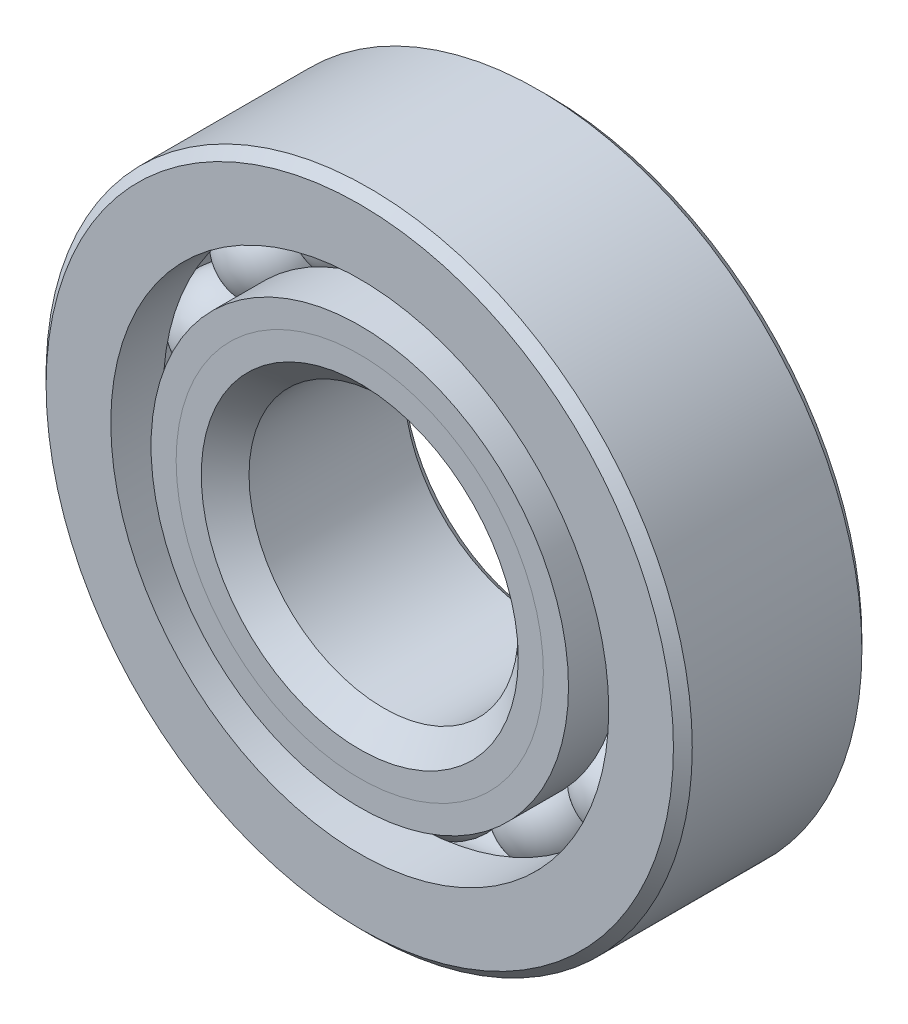
ISO-10303-21;
HEADER;
FILE_DESCRIPTION(('STEP AP214'),'2;1');
FILE_NAME('part.step','',(''),(''),'','','');
FILE_SCHEMA(('AUTOMOTIVE_DESIGN { 1 0 10303 214 1 1 1 1 }'));
ENDSEC;
DATA;
#1=APPLICATION_CONTEXT('core data for automotive mechanical design processes');
#2=APPLICATION_PROTOCOL_DEFINITION('international standard','automotive_design',2000,#1);
#3=PRODUCT_CONTEXT('',#1,'mechanical');
#4=PRODUCT('Part','Part','',(#3));
#5=PRODUCT_RELATED_PRODUCT_CATEGORY('part','',(#4));
#6=PRODUCT_DEFINITION_FORMATION('','',#4);
#7=PRODUCT_DEFINITION_CONTEXT('part definition',#1,'design');
#8=PRODUCT_DEFINITION('design','',#6,#7);
#9=PRODUCT_DEFINITION_SHAPE('','',#8);
#10=(LENGTH_UNIT() NAMED_UNIT(*) SI_UNIT(.MILLI.,.METRE.));
#11=(NAMED_UNIT(*) PLANE_ANGLE_UNIT() SI_UNIT($,.RADIAN.));
#12=(NAMED_UNIT(*) SI_UNIT($,.STERADIAN.) SOLID_ANGLE_UNIT());
#13=UNCERTAINTY_MEASURE_WITH_UNIT(LENGTH_MEASURE(1.E-05),#10,'distance_accuracy_value','');
#14=(GEOMETRIC_REPRESENTATION_CONTEXT(3) GLOBAL_UNCERTAINTY_ASSIGNED_CONTEXT((#13)) GLOBAL_UNIT_ASSIGNED_CONTEXT((#10,
#11,#12)) REPRESENTATION_CONTEXT('',''));
#15=CARTESIAN_POINT('',(0.,0.,0.));
#16=DIRECTION('',(0.,0.,1.));
#17=DIRECTION('',(1.,0.,0.));
#18=AXIS2_PLACEMENT_3D('',#15,#16,#17);
#19=CARTESIAN_POINT('',(-5.85471870471739,12.1574486612583,0.));
#20=DIRECTION('',(0.,0.,1.));
#21=DIRECTION('',(-0.433883739117546,0.900968867902425,0.));
#22=AXIS2_PLACEMENT_3D('',#19,#20,#21);
#23=SPHERICAL_SURFACE('',#22,2.7395944072384);
#24=CARTESIAN_POINT('',(-5.85471870471739,12.1574486612583,2.7395944072384));
#25=VERTEX_POINT('',#24);
#26=VERTEX_LOOP('',#25);
#27=FACE_BOUND('',#26,.T.);
#28=ADVANCED_FACE('F43',(#27),#23,.T.);
#29=CLOSED_SHELL('',(#28));
#30=MANIFOLD_SOLID_BREP('B2',#29);
#31=CARTESIAN_POINT('',(-10.5498385665529,8.41321551383141,0.));
#32=DIRECTION('',(0.,0.,1.));
#33=DIRECTION('',(-0.781831482468022,0.623489801858743,0.));
#34=AXIS2_PLACEMENT_3D('',#31,#32,#33);
#35=SPHERICAL_SURFACE('',#34,2.7395944072384);
#36=CARTESIAN_POINT('',(-10.5498385665529,8.41321551383141,2.7395944072384));
#37=VERTEX_POINT('',#36);
#38=VERTEX_LOOP('',#37);
#39=FACE_BOUND('',#38,.T.);
#40=ADVANCED_FACE('F76',(#39),#35,.T.);
#41=CLOSED_SHELL('',(#40));
#42=MANIFOLD_SOLID_BREP('B6',#41);
#43=CARTESIAN_POINT('',(-13.1554335150035,3.00264185257316,0.));
#44=DIRECTION('',(0.,0.,1.));
#45=DIRECTION('',(-0.974927912181821,0.222520933956325,0.));
#46=AXIS2_PLACEMENT_3D('',#43,#44,#45);
#47=SPHERICAL_SURFACE('',#46,2.7395944072384);
#48=CARTESIAN_POINT('',(-13.1554335150035,3.00264185257316,2.7395944072384));
#49=VERTEX_POINT('',#48);
#50=VERTEX_LOOP('',#49);
#51=FACE_BOUND('',#50,.T.);
#52=ADVANCED_FACE('F109',(#51),#47,.T.);
#53=CLOSED_SHELL('',(#52));
#54=MANIFOLD_SOLID_BREP('B39',#53);
#55=CARTESIAN_POINT('',(-13.1554335150035,-3.00264185257289,0.));
#56=DIRECTION('',(0.,0.,1.));
#57=DIRECTION('',(-0.974927912181826,-0.222520933956305,0.));
#58=AXIS2_PLACEMENT_3D('',#55,#56,#57);
#59=SPHERICAL_SURFACE('',#58,2.7395944072384);
#60=CARTESIAN_POINT('',(-13.1554335150035,-3.00264185257289,2.7395944072384));
#61=VERTEX_POINT('',#60);
#62=VERTEX_LOOP('',#61);
#63=FACE_BOUND('',#62,.T.);
#64=ADVANCED_FACE('F142',(#63),#59,.T.);
#65=CLOSED_SHELL('',(#64));
#66=MANIFOLD_SOLID_BREP('B72',#65);
#67=CARTESIAN_POINT('',(-10.5498385665531,-8.41321551383119,0.));
#68=DIRECTION('',(0.,0.,1.));
#69=DIRECTION('',(-0.781831482468035,-0.623489801858727,0.));
#70=AXIS2_PLACEMENT_3D('',#67,#68,#69);
#71=SPHERICAL_SURFACE('',#70,2.7395944072384);
#72=CARTESIAN_POINT('',(-10.5498385665531,-8.41321551383119,2.7395944072384));
#73=VERTEX_POINT('',#72);
#74=VERTEX_LOOP('',#73);
#75=FACE_BOUND('',#74,.T.);
#76=ADVANCED_FACE('F173',(#75),#71,.T.);
#77=CLOSED_SHELL('',(#76));
#78=MANIFOLD_SOLID_BREP('B105',#77);
#79=CARTESIAN_POINT('',(-5.85471870471765,-12.1574486612582,0.));
#80=DIRECTION('',(0.,0.,1.));
#81=DIRECTION('',(-0.433883739117565,-0.900968867902416,0.));
#82=AXIS2_PLACEMENT_3D('',#79,#80,#81);
#83=SPHERICAL_SURFACE('',#82,2.7395944072384);
#84=CARTESIAN_POINT('',(-5.85471870471765,-12.1574486612582,2.7395944072384));
#85=VERTEX_POINT('',#84);
#86=VERTEX_LOOP('',#85);
#87=FACE_BOUND('',#86,.T.);
#88=ADVANCED_FACE('F204',(#87),#83,.T.);
#89=CLOSED_SHELL('',(#88));
#90=MANIFOLD_SOLID_BREP('B138',#89);
#91=CARTESIAN_POINT('',(0.,-13.49375,0.));
#92=DIRECTION('',(0.,0.,1.));
#93=DIRECTION('',(0.,-1.,0.));
#94=AXIS2_PLACEMENT_3D('',#91,#92,#93);
#95=SPHERICAL_SURFACE('',#94,2.7395944072384);
#96=CARTESIAN_POINT('',(0.,-13.49375,2.7395944072384));
#97=VERTEX_POINT('',#96);
#98=VERTEX_LOOP('',#97);
#99=FACE_BOUND('',#98,.T.);
#100=ADVANCED_FACE('F235',(#99),#95,.T.);
#101=CLOSED_SHELL('',(#100));
#102=MANIFOLD_SOLID_BREP('B169',#101);
#103=CARTESIAN_POINT('',(5.85471870471748,-12.1574486612583,0.));
#104=DIRECTION('',(0.,0.,1.));
#105=DIRECTION('',(0.433883739117553,-0.900968867902422,0.));
#106=AXIS2_PLACEMENT_3D('',#103,#104,#105);
#107=SPHERICAL_SURFACE('',#106,2.7395944072384);
#108=CARTESIAN_POINT('',(5.85471870471748,-12.1574486612583,2.7395944072384));
#109=VERTEX_POINT('',#108);
#110=VERTEX_LOOP('',#109);
#111=FACE_BOUND('',#110,.T.);
#112=ADVANCED_FACE('F266',(#111),#107,.T.);
#113=CLOSED_SHELL('',(#112));
#114=MANIFOLD_SOLID_BREP('B200',#113);
#115=CARTESIAN_POINT('',(10.5498385665529,-8.41321551383134,0.));
#116=DIRECTION('',(0.,0.,1.));
#117=DIRECTION('',(0.781831482468027,-0.623489801858737,0.));
#118=AXIS2_PLACEMENT_3D('',#115,#116,#117);
#119=SPHERICAL_SURFACE('',#118,2.7395944072384);
#120=CARTESIAN_POINT('',(10.5498385665529,-8.41321551383134,2.7395944072384));
#121=VERTEX_POINT('',#120);
#122=VERTEX_LOOP('',#121);
#123=FACE_BOUND('',#122,.T.);
#124=ADVANCED_FACE('F299',(#123),#119,.T.);
#125=CLOSED_SHELL('',(#124));
#126=MANIFOLD_SOLID_BREP('B231',#125);
#127=CARTESIAN_POINT('',(13.1554335150035,-3.00264185257307,0.));
#128=DIRECTION('',(0.,0.,1.));
#129=DIRECTION('',(0.974927912181823,-0.222520933956318,0.));
#130=AXIS2_PLACEMENT_3D('',#127,#128,#129);
#131=SPHERICAL_SURFACE('',#130,2.7395944072384);
#132=CARTESIAN_POINT('',(13.1554335150035,-3.00264185257307,2.7395944072384));
#133=VERTEX_POINT('',#132);
#134=VERTEX_LOOP('',#133);
#135=FACE_BOUND('',#134,.T.);
#136=ADVANCED_FACE('F332',(#135),#131,.T.);
#137=CLOSED_SHELL('',(#136));
#138=MANIFOLD_SOLID_BREP('B262',#137);
#139=CARTESIAN_POINT('',(13.1554335150035,3.00264185257298,0.));
#140=DIRECTION('',(0.,0.,1.));
#141=DIRECTION('',(0.974927912181824,0.222520933956311,0.));
#142=AXIS2_PLACEMENT_3D('',#139,#140,#141);
#143=SPHERICAL_SURFACE('',#142,2.7395944072384);
#144=CARTESIAN_POINT('',(13.1554335150035,3.00264185257298,2.7395944072384));
#145=VERTEX_POINT('',#144);
#146=VERTEX_LOOP('',#145);
#147=FACE_BOUND('',#146,.T.);
#148=ADVANCED_FACE('F363',(#147),#143,.T.);
#149=CLOSED_SHELL('',(#148));
#150=MANIFOLD_SOLID_BREP('B295',#149);
#151=CARTESIAN_POINT('',(10.549838566553,8.41321551383127,0.));
#152=DIRECTION('',(0.,0.,1.));
#153=DIRECTION('',(0.781831482468031,0.623489801858732,0.));
#154=AXIS2_PLACEMENT_3D('',#151,#152,#153);
#155=SPHERICAL_SURFACE('',#154,2.7395944072384);
#156=CARTESIAN_POINT('',(10.549838566553,8.41321551383127,2.7395944072384));
#157=VERTEX_POINT('',#156);
#158=VERTEX_LOOP('',#157);
#159=FACE_BOUND('',#158,.T.);
#160=ADVANCED_FACE('F394',(#159),#155,.T.);
#161=CLOSED_SHELL('',(#160));
#162=MANIFOLD_SOLID_BREP('B328',#161);
#163=CARTESIAN_POINT('',(5.85471870471756,12.1574486612583,0.));
#164=DIRECTION('',(0.,0.,1.));
#165=DIRECTION('',(0.433883739117559,0.900968867902419,0.));
#166=AXIS2_PLACEMENT_3D('',#163,#164,#165);
#167=SPHERICAL_SURFACE('',#166,2.7395944072384);
#168=CARTESIAN_POINT('',(5.85471870471756,12.1574486612583,2.7395944072384));
#169=VERTEX_POINT('',#168);
#170=VERTEX_LOOP('',#169);
#171=FACE_BOUND('',#170,.T.);
#172=ADVANCED_FACE('F427',(#171),#167,.T.);
#173=CLOSED_SHELL('',(#172));
#174=MANIFOLD_SOLID_BREP('B359',#173);
#175=CARTESIAN_POINT('',(0.,13.49375,0.));
#176=DIRECTION('',(0.,0.,1.));
#177=DIRECTION('',(0.,1.,0.));
#178=AXIS2_PLACEMENT_3D('',#175,#176,#177);
#179=SPHERICAL_SURFACE('',#178,2.7395944072384);
#180=CARTESIAN_POINT('',(0.,13.49375,2.7395944072384));
#181=VERTEX_POINT('',#180);
#182=VERTEX_LOOP('',#181);
#183=FACE_BOUND('',#182,.T.);
#184=ADVANCED_FACE('F462',(#183),#179,.T.);
#185=CLOSED_SHELL('',(#184));
#186=MANIFOLD_SOLID_BREP('B390',#185);
#187=CARTESIAN_POINT('',(0.,10.8266570300585,5.55625));
#188=DIRECTION('',(0.,0.,-1.));
#189=DIRECTION('',(-1.,0.,0.));
#190=AXIS2_PLACEMENT_3D('',#187,#188,#189);
#191=PLANE('',#190);
#192=CARTESIAN_POINT('',(0.,0.,5.55625));
#193=DIRECTION('',(0.,0.,1.));
#194=DIRECTION('',(1.,0.,0.));
#195=AXIS2_PLACEMENT_3D('',#192,#193,#194);
#196=CIRCLE('',#195,9.3458277963808);
#197=CARTESIAN_POINT('',(9.3458277963808,0.,5.55625));
#198=VERTEX_POINT('',#197);
#199=EDGE_CURVE('E516',#198,#198,#196,.T.);
#200=ORIENTED_EDGE('',*,*,#199,.F.);
#201=EDGE_LOOP('',(#200));
#202=FACE_BOUND('',#201,.T.);
#203=CARTESIAN_POINT('',(0.,0.,5.55625));
#204=DIRECTION('',(0.,0.,1.));
#205=DIRECTION('',(1.,0.,0.));
#206=AXIS2_PLACEMENT_3D('',#203,#204,#205);
#207=CIRCLE('',#206,10.8266570300585);
#208=CARTESIAN_POINT('',(10.8266570300585,0.,5.55625));
#209=VERTEX_POINT('',#208);
#210=EDGE_CURVE('E461',#209,#209,#207,.T.);
#211=ORIENTED_EDGE('',*,*,#210,.T.);
#212=EDGE_LOOP('',(#211));
#213=FACE_BOUND('',#212,.T.);
#214=ADVANCED_FACE('F482',(#202,#213),#191,.F.);
#215=CARTESIAN_POINT('',(0.,0.,4.07542076632228));
#216=DIRECTION('',(0.,0.,1.));
#217=DIRECTION('',(1.,0.,0.));
#218=AXIS2_PLACEMENT_3D('',#215,#216,#217);
#219=CONICAL_SURFACE('',#218,9.3458277963808,0.785398163397451);
#220=ORIENTED_EDGE('',*,*,#210,.F.);
#221=EDGE_LOOP('',(#220));
#222=FACE_BOUND('',#221,.T.);
#223=CARTESIAN_POINT('',(0.,0.,4.07542076632228));
#224=DIRECTION('',(0.,0.,1.));
#225=DIRECTION('',(1.,0.,0.));
#226=AXIS2_PLACEMENT_3D('',#223,#224,#225);
#227=CIRCLE('',#226,9.3458277963808);
#228=CARTESIAN_POINT('',(9.3458277963808,0.,4.07542076632228));
#229=VERTEX_POINT('',#228);
#230=EDGE_CURVE('E488',#229,#229,#227,.T.);
#231=ORIENTED_EDGE('',*,*,#230,.T.);
#232=EDGE_LOOP('',(#231));
#233=FACE_BOUND('',#232,.T.);
#234=ADVANCED_FACE('F523',(#222,#233),#219,.T.);
#235=CARTESIAN_POINT('',(0.,0.,5.55625));
#236=DIRECTION('',(0.,0.,1.));
#237=DIRECTION('',(1.,0.,0.));
#238=AXIS2_PLACEMENT_3D('',#235,#236,#237);
#239=CYLINDRICAL_SURFACE('',#238,9.3458277963808);
#240=ORIENTED_EDGE('',*,*,#230,.F.);
#241=EDGE_LOOP('',(#240));
#242=FACE_BOUND('',#241,.T.);
#243=CARTESIAN_POINT('',(0.,0.,0.));
#244=DIRECTION('',(0.,0.,1.));
#245=DIRECTION('',(1.,0.,0.));
#246=AXIS2_PLACEMENT_3D('',#243,#244,#245);
#247=CIRCLE('',#246,9.3458277963808);
#248=CARTESIAN_POINT('',(9.3458277963808,0.,0.));
#249=VERTEX_POINT('',#248);
#250=EDGE_CURVE('E492',#249,#249,#247,.T.);
#251=ORIENTED_EDGE('',*,*,#250,.T.);
#252=EDGE_LOOP('',(#251));
#253=FACE_BOUND('',#252,.T.);
#254=ADVANCED_FACE('F527',(#242,#253),#239,.T.);
#255=CARTESIAN_POINT('',(0.,9.3458277963808,0.));
#256=DIRECTION('',(0.,0.,-1.));
#257=DIRECTION('',(-1.,0.,0.));
#258=AXIS2_PLACEMENT_3D('',#255,#256,#257);
#259=PLANE('',#258);
#260=ORIENTED_EDGE('',*,*,#250,.F.);
#261=EDGE_LOOP('',(#260));
#262=FACE_BOUND('',#261,.T.);
#263=CARTESIAN_POINT('',(0.,0.,0.));
#264=DIRECTION('',(0.,0.,1.));
#265=DIRECTION('',(1.,0.,0.));
#266=AXIS2_PLACEMENT_3D('',#263,#264,#265);
#267=CIRCLE('',#266,10.7541555927616);
#268=CARTESIAN_POINT('',(10.7541555927616,0.,0.));
#269=VERTEX_POINT('',#268);
#270=EDGE_CURVE('E496',#269,#269,#267,.T.);
#271=ORIENTED_EDGE('',*,*,#270,.T.);
#272=EDGE_LOOP('',(#271));
#273=FACE_BOUND('',#272,.T.);
#274=ADVANCED_FACE('F532',(#262,#273),#259,.F.);
#275=CARTESIAN_POINT('',(0.,0.,0.));
#276=DIRECTION('',(0.,0.,1.));
#277=DIRECTION('',(1.,0.,0.));
#278=AXIS2_PLACEMENT_3D('',#275,#276,#277);
#279=TOROIDAL_SURFACE('',#278,13.49375,2.7395944072384);
#280=ORIENTED_EDGE('',*,*,#270,.F.);
#281=EDGE_LOOP('',(#280));
#282=FACE_BOUND('',#281,.T.);
#283=CARTESIAN_POINT('',(0.,0.,-2.46944444444444));
#284=DIRECTION('',(0.,0.,1.));
#285=DIRECTION('',(1.,0.,0.));
#286=AXIS2_PLACEMENT_3D('',#283,#284,#285);
#287=CIRCLE('',#286,12.3074862637363);
#288=CARTESIAN_POINT('',(12.3074862637363,0.,-2.46944444444444));
#289=VERTEX_POINT('',#288);
#290=EDGE_CURVE('E501',#289,#289,#287,.T.);
#291=ORIENTED_EDGE('',*,*,#290,.T.);
#292=EDGE_LOOP('',(#291));
#293=FACE_BOUND('',#292,.T.);
#294=ADVANCED_FACE('F538',(#282,#293),#279,.F.);
#295=CARTESIAN_POINT('',(0.,0.,5.55625));
#296=DIRECTION('',(0.,0.,1.));
#297=DIRECTION('',(1.,0.,0.));
#298=AXIS2_PLACEMENT_3D('',#295,#296,#297);
#299=CYLINDRICAL_SURFACE('',#298,12.3074862637363);
#300=ORIENTED_EDGE('',*,*,#290,.F.);
#301=EDGE_LOOP('',(#300));
#302=FACE_BOUND('',#301,.T.);
#303=CARTESIAN_POINT('',(0.,0.,-5.55625));
#304=DIRECTION('',(0.,0.,1.));
#305=DIRECTION('',(1.,0.,0.));
#306=AXIS2_PLACEMENT_3D('',#303,#304,#305);
#307=CIRCLE('',#306,12.3074862637363);
#308=CARTESIAN_POINT('',(12.3074862637363,0.,-5.55625));
#309=VERTEX_POINT('',#308);
#310=EDGE_CURVE('E504',#309,#309,#307,.T.);
#311=ORIENTED_EDGE('',*,*,#310,.T.);
#312=EDGE_LOOP('',(#311));
#313=FACE_BOUND('',#312,.T.);
#314=ADVANCED_FACE('F542',(#302,#313),#299,.T.);
#315=CARTESIAN_POINT('',(0.,8.493125,-5.55625));
#316=DIRECTION('',(0.,0.,1.));
#317=DIRECTION('',(1.,0.,0.));
#318=AXIS2_PLACEMENT_3D('',#315,#316,#317);
#319=PLANE('',#318);
#320=ORIENTED_EDGE('',*,*,#310,.F.);
#321=EDGE_LOOP('',(#320));
#322=FACE_BOUND('',#321,.T.);
#323=CARTESIAN_POINT('',(0.,0.,-5.55625));
#324=DIRECTION('',(0.,0.,1.));
#325=DIRECTION('',(1.,0.,0.));
#326=AXIS2_PLACEMENT_3D('',#323,#324,#325);
#327=CIRCLE('',#326,8.493125);
#328=CARTESIAN_POINT('',(8.493125,0.,-5.55625));
#329=VERTEX_POINT('',#328);
#330=EDGE_CURVE('E507',#329,#329,#327,.T.);
#331=ORIENTED_EDGE('',*,*,#330,.T.);
#332=EDGE_LOOP('',(#331));
#333=FACE_BOUND('',#332,.T.);
#334=ADVANCED_FACE('F546',(#322,#333),#319,.F.);
#335=CARTESIAN_POINT('',(0.,0.,-5.000625));
#336=DIRECTION('',(0.,0.,-1.));
#337=DIRECTION('',(-1.,0.,0.));
#338=AXIS2_PLACEMENT_3D('',#335,#336,#337);
#339=CONICAL_SURFACE('',#338,7.9375,0.785398163397447);
#340=ORIENTED_EDGE('',*,*,#330,.F.);
#341=EDGE_LOOP('',(#340));
#342=FACE_BOUND('',#341,.T.);
#343=CARTESIAN_POINT('',(0.,0.,-5.000625));
#344=DIRECTION('',(0.,0.,1.));
#345=DIRECTION('',(1.,0.,0.));
#346=AXIS2_PLACEMENT_3D('',#343,#344,#345);
#347=CIRCLE('',#346,7.9375);
#348=CARTESIAN_POINT('',(7.9375,0.,-5.000625));
#349=VERTEX_POINT('',#348);
#350=EDGE_CURVE('E510',#349,#349,#347,.T.);
#351=ORIENTED_EDGE('',*,*,#350,.T.);
#352=EDGE_LOOP('',(#351));
#353=FACE_BOUND('',#352,.T.);
#354=ADVANCED_FACE('F550',(#342,#353),#339,.F.);
#355=CARTESIAN_POINT('',(0.,0.,5.55625));
#356=DIRECTION('',(0.,0.,1.));
#357=DIRECTION('',(1.,0.,0.));
#358=AXIS2_PLACEMENT_3D('',#355,#356,#357);
#359=CYLINDRICAL_SURFACE('',#358,7.9375);
#360=ORIENTED_EDGE('',*,*,#350,.F.);
#361=EDGE_LOOP('',(#360));
#362=FACE_BOUND('',#361,.T.);
#363=CARTESIAN_POINT('',(0.,0.,4.14792220361921));
#364=DIRECTION('',(0.,0.,1.));
#365=DIRECTION('',(1.,0.,0.));
#366=AXIS2_PLACEMENT_3D('',#363,#364,#365);
#367=CIRCLE('',#366,7.9375);
#368=CARTESIAN_POINT('',(7.9375,0.,4.14792220361921));
#369=VERTEX_POINT('',#368);
#370=EDGE_CURVE('E513',#369,#369,#367,.T.);
#371=ORIENTED_EDGE('',*,*,#370,.T.);
#372=EDGE_LOOP('',(#371));
#373=FACE_BOUND('',#372,.T.);
#374=ADVANCED_FACE('F554',(#362,#373),#359,.F.);
#375=CARTESIAN_POINT('',(0.,0.,5.55625));
#376=DIRECTION('',(0.,0.,1.));
#377=DIRECTION('',(1.,0.,0.));
#378=AXIS2_PLACEMENT_3D('',#375,#376,#377);
#379=CONICAL_SURFACE('',#378,9.3458277963808,0.785398163397451);
#380=ORIENTED_EDGE('',*,*,#370,.F.);
#381=EDGE_LOOP('',(#380));
#382=FACE_BOUND('',#381,.T.);
#383=ORIENTED_EDGE('',*,*,#199,.T.);
#384=EDGE_LOOP('',(#383));
#385=FACE_BOUND('',#384,.T.);
#386=ADVANCED_FACE('F520',(#382,#385),#379,.F.);
#387=CLOSED_SHELL('',(#214,#234,#254,#274,#294,#314,#334,#354,#374,#386));
#388=MANIFOLD_SOLID_BREP('B423',#387);
#389=CARTESIAN_POINT('',(0.,12.3074862637363,5.55625));
#390=DIRECTION('',(0.,0.,-1.));
#391=DIRECTION('',(-1.,0.,0.));
#392=AXIS2_PLACEMENT_3D('',#389,#390,#391);
#393=PLANE('',#392);
#394=CARTESIAN_POINT('',(0.,0.,5.55625));
#395=DIRECTION('',(0.,0.,1.));
#396=DIRECTION('',(1.,0.,0.));
#397=AXIS2_PLACEMENT_3D('',#394,#395,#396);
#398=CIRCLE('',#397,10.8266570300585);
#399=CARTESIAN_POINT('',(10.8266570300585,0.,5.55625));
#400=VERTEX_POINT('',#399);
#401=EDGE_CURVE('E481',#400,#400,#398,.T.);
#402=ORIENTED_EDGE('',*,*,#401,.F.);
#403=EDGE_LOOP('',(#402));
#404=FACE_BOUND('',#403,.T.);
#405=CARTESIAN_POINT('',(0.,0.,5.55625));
#406=DIRECTION('',(0.,0.,1.));
#407=DIRECTION('',(1.,0.,0.));
#408=AXIS2_PLACEMENT_3D('',#405,#406,#407);
#409=CIRCLE('',#408,12.3074862637363);
#410=CARTESIAN_POINT('',(12.3074862637363,0.,5.55625));
#411=VERTEX_POINT('',#410);
#412=EDGE_CURVE('E662',#411,#411,#409,.T.);
#413=ORIENTED_EDGE('',*,*,#412,.T.);
#414=EDGE_LOOP('',(#413));
#415=FACE_BOUND('',#414,.T.);
#416=ADVANCED_FACE('F640',(#404,#415),#393,.F.);
#417=CARTESIAN_POINT('',(0.,0.,5.55625));
#418=DIRECTION('',(0.,0.,1.));
#419=DIRECTION('',(1.,0.,0.));
#420=AXIS2_PLACEMENT_3D('',#417,#418,#419);
#421=CONICAL_SURFACE('',#420,10.8266570300585,0.785398163397451);
#422=CARTESIAN_POINT('',(0.,0.,4.07542076632228));
#423=DIRECTION('',(0.,0.,1.));
#424=DIRECTION('',(1.,0.,0.));
#425=AXIS2_PLACEMENT_3D('',#422,#423,#424);
#426=CIRCLE('',#425,9.3458277963808);
#427=CARTESIAN_POINT('',(9.3458277963808,0.,4.07542076632228));
#428=VERTEX_POINT('',#427);
#429=EDGE_CURVE('E646',#428,#428,#426,.T.);
#430=ORIENTED_EDGE('',*,*,#429,.F.);
#431=EDGE_LOOP('',(#430));
#432=FACE_BOUND('',#431,.T.);
#433=ORIENTED_EDGE('',*,*,#401,.T.);
#434=EDGE_LOOP('',(#433));
#435=FACE_BOUND('',#434,.T.);
#436=ADVANCED_FACE('F687',(#432,#435),#421,.F.);
#437=CARTESIAN_POINT('',(0.,0.,5.55625));
#438=DIRECTION('',(0.,0.,1.));
#439=DIRECTION('',(1.,0.,0.));
#440=AXIS2_PLACEMENT_3D('',#437,#438,#439);
#441=CYLINDRICAL_SURFACE('',#440,9.3458277963808);
#442=CARTESIAN_POINT('',(0.,0.,0.));
#443=DIRECTION('',(0.,0.,1.));
#444=DIRECTION('',(1.,0.,0.));
#445=AXIS2_PLACEMENT_3D('',#442,#443,#444);
#446=CIRCLE('',#445,9.3458277963808);
#447=CARTESIAN_POINT('',(9.3458277963808,0.,0.));
#448=VERTEX_POINT('',#447);
#449=EDGE_CURVE('E650',#448,#448,#446,.T.);
#450=ORIENTED_EDGE('',*,*,#449,.F.);
#451=EDGE_LOOP('',(#450));
#452=FACE_BOUND('',#451,.T.);
#453=ORIENTED_EDGE('',*,*,#429,.T.);
#454=EDGE_LOOP('',(#453));
#455=FACE_BOUND('',#454,.T.);
#456=ADVANCED_FACE('F682',(#452,#455),#441,.F.);
#457=CARTESIAN_POINT('',(0.,9.3458277963808,0.));
#458=DIRECTION('',(0.,0.,1.));
#459=DIRECTION('',(1.,0.,0.));
#460=AXIS2_PLACEMENT_3D('',#457,#458,#459);
#461=PLANE('',#460);
#462=CARTESIAN_POINT('',(0.,0.,0.));
#463=DIRECTION('',(0.,0.,1.));
#464=DIRECTION('',(1.,0.,0.));
#465=AXIS2_PLACEMENT_3D('',#462,#463,#464);
#466=CIRCLE('',#465,10.7541555927616);
#467=CARTESIAN_POINT('',(10.7541555927616,0.,0.));
#468=VERTEX_POINT('',#467);
#469=EDGE_CURVE('E654',#468,#468,#466,.T.);
#470=ORIENTED_EDGE('',*,*,#469,.F.);
#471=EDGE_LOOP('',(#470));
#472=FACE_BOUND('',#471,.T.);
#473=ORIENTED_EDGE('',*,*,#449,.T.);
#474=EDGE_LOOP('',(#473));
#475=FACE_BOUND('',#474,.T.);
#476=ADVANCED_FACE('F676',(#472,#475),#461,.F.);
#477=CARTESIAN_POINT('',(0.,0.,0.));
#478=DIRECTION('',(0.,0.,1.));
#479=DIRECTION('',(1.,0.,0.));
#480=AXIS2_PLACEMENT_3D('',#477,#478,#479);
#481=TOROIDAL_SURFACE('',#480,13.49375,2.7395944072384);
#482=CARTESIAN_POINT('',(0.,0.,2.46944444444444));
#483=DIRECTION('',(0.,0.,1.));
#484=DIRECTION('',(1.,0.,0.));
#485=AXIS2_PLACEMENT_3D('',#482,#483,#484);
#486=CIRCLE('',#485,12.3074862637363);
#487=CARTESIAN_POINT('',(12.3074862637363,0.,2.46944444444444));
#488=VERTEX_POINT('',#487);
#489=EDGE_CURVE('E659',#488,#488,#486,.T.);
#490=ORIENTED_EDGE('',*,*,#489,.F.);
#491=EDGE_LOOP('',(#490));
#492=FACE_BOUND('',#491,.T.);
#493=ORIENTED_EDGE('',*,*,#469,.T.);
#494=EDGE_LOOP('',(#493));
#495=FACE_BOUND('',#494,.T.);
#496=ADVANCED_FACE('F670',(#492,#495),#481,.F.);
#497=CARTESIAN_POINT('',(0.,0.,5.55625));
#498=DIRECTION('',(0.,0.,1.));
#499=DIRECTION('',(1.,0.,0.));
#500=AXIS2_PLACEMENT_3D('',#497,#498,#499);
#501=CYLINDRICAL_SURFACE('',#500,12.3074862637363);
#502=ORIENTED_EDGE('',*,*,#412,.F.);
#503=EDGE_LOOP('',(#502));
#504=FACE_BOUND('',#503,.T.);
#505=ORIENTED_EDGE('',*,*,#489,.T.);
#506=EDGE_LOOP('',(#505));
#507=FACE_BOUND('',#506,.T.);
#508=ADVANCED_FACE('F667',(#504,#507),#501,.T.);
#509=CLOSED_SHELL('',(#416,#436,#456,#476,#496,#508));
#510=MANIFOLD_SOLID_BREP('B456',#509);
#511=CARTESIAN_POINT('',(0.,0.,5.000625));
#512=DIRECTION('',(0.,0.,-1.));
#513=DIRECTION('',(-1.,0.,0.));
#514=AXIS2_PLACEMENT_3D('',#511,#512,#513);
#515=CONICAL_SURFACE('',#514,19.05,0.785398163397446);
#516=CARTESIAN_POINT('',(0.,0.,5.55625));
#517=DIRECTION('',(0.,0.,1.));
#518=DIRECTION('',(1.,0.,0.));
#519=AXIS2_PLACEMENT_3D('',#516,#517,#518);
#520=CIRCLE('',#519,18.494375);
#521=CARTESIAN_POINT('',(18.494375,0.,5.55625));
#522=VERTEX_POINT('',#521);
#523=EDGE_CURVE('E759',#522,#522,#520,.T.);
#524=ORIENTED_EDGE('',*,*,#523,.F.);
#525=EDGE_LOOP('',(#524));
#526=FACE_BOUND('',#525,.T.);
#527=CARTESIAN_POINT('',(0.,0.,5.000625));
#528=DIRECTION('',(0.,0.,1.));
#529=DIRECTION('',(1.,0.,0.));
#530=AXIS2_PLACEMENT_3D('',#527,#528,#529);
#531=CIRCLE('',#530,19.05);
#532=CARTESIAN_POINT('',(19.05,0.,5.000625));
#533=VERTEX_POINT('',#532);
#534=EDGE_CURVE('E639',#533,#533,#531,.T.);
#535=ORIENTED_EDGE('',*,*,#534,.T.);
#536=EDGE_LOOP('',(#535));
#537=FACE_BOUND('',#536,.T.);
#538=ADVANCED_FACE('F731',(#526,#537),#515,.T.);
#539=CARTESIAN_POINT('',(0.,0.,5.55625));
#540=DIRECTION('',(0.,0.,1.));
#541=DIRECTION('',(1.,0.,0.));
#542=AXIS2_PLACEMENT_3D('',#539,#540,#541);
#543=CYLINDRICAL_SURFACE('',#542,19.05);
#544=ORIENTED_EDGE('',*,*,#534,.F.);
#545=EDGE_LOOP('',(#544));
#546=FACE_BOUND('',#545,.T.);
#547=CARTESIAN_POINT('',(0.,0.,-5.000625));
#548=DIRECTION('',(0.,0.,1.));
#549=DIRECTION('',(1.,0.,0.));
#550=AXIS2_PLACEMENT_3D('',#547,#548,#549);
#551=CIRCLE('',#550,19.05);
#552=CARTESIAN_POINT('',(19.05,0.,-5.000625));
#553=VERTEX_POINT('',#552);
#554=EDGE_CURVE('E737',#553,#553,#551,.T.);
#555=ORIENTED_EDGE('',*,*,#554,.T.);
#556=EDGE_LOOP('',(#555));
#557=FACE_BOUND('',#556,.T.);
#558=ADVANCED_FACE('F766',(#546,#557),#543,.T.);
#559=CARTESIAN_POINT('',(0.,0.,-5.55625));
#560=DIRECTION('',(0.,0.,1.));
#561=DIRECTION('',(1.,0.,0.));
#562=AXIS2_PLACEMENT_3D('',#559,#560,#561);
#563=CONICAL_SURFACE('',#562,18.494375,0.785398163397447);
#564=ORIENTED_EDGE('',*,*,#554,.F.);
#565=EDGE_LOOP('',(#564));
#566=FACE_BOUND('',#565,.T.);
#567=CARTESIAN_POINT('',(0.,0.,-5.55625));
#568=DIRECTION('',(0.,0.,1.));
#569=DIRECTION('',(1.,0.,0.));
#570=AXIS2_PLACEMENT_3D('',#567,#568,#569);
#571=CIRCLE('',#570,18.494375);
#572=CARTESIAN_POINT('',(18.494375,0.,-5.55625));
#573=VERTEX_POINT('',#572);
#574=EDGE_CURVE('E741',#573,#573,#571,.T.);
#575=ORIENTED_EDGE('',*,*,#574,.T.);
#576=EDGE_LOOP('',(#575));
#577=FACE_BOUND('',#576,.T.);
#578=ADVANCED_FACE('F770',(#566,#577),#563,.T.);
#579=CARTESIAN_POINT('',(0.,18.494375,-5.55625));
#580=DIRECTION('',(0.,0.,1.));
#581=DIRECTION('',(1.,0.,0.));
#582=AXIS2_PLACEMENT_3D('',#579,#580,#581);
#583=PLANE('',#582);
#584=ORIENTED_EDGE('',*,*,#574,.F.);
#585=EDGE_LOOP('',(#584));
#586=FACE_BOUND('',#585,.T.);
#587=CARTESIAN_POINT('',(0.,0.,-5.55625));
#588=DIRECTION('',(0.,0.,1.));
#589=DIRECTION('',(1.,0.,0.));
#590=AXIS2_PLACEMENT_3D('',#587,#588,#589);
#591=CIRCLE('',#590,14.6800137362637);
#592=CARTESIAN_POINT('',(14.6800137362637,0.,-5.55625));
#593=VERTEX_POINT('',#592);
#594=EDGE_CURVE('E745',#593,#593,#591,.T.);
#595=ORIENTED_EDGE('',*,*,#594,.T.);
#596=EDGE_LOOP('',(#595));
#597=FACE_BOUND('',#596,.T.);
#598=ADVANCED_FACE('F775',(#586,#597),#583,.F.);
#599=CARTESIAN_POINT('',(0.,0.,5.55625));
#600=DIRECTION('',(0.,0.,1.));
#601=DIRECTION('',(1.,0.,0.));
#602=AXIS2_PLACEMENT_3D('',#599,#600,#601);
#603=CYLINDRICAL_SURFACE('',#602,14.6800137362637);
#604=ORIENTED_EDGE('',*,*,#594,.F.);
#605=EDGE_LOOP('',(#604));
#606=FACE_BOUND('',#605,.T.);
#607=CARTESIAN_POINT('',(0.,0.,-2.46944444444444));
#608=DIRECTION('',(0.,0.,1.));
#609=DIRECTION('',(1.,0.,0.));
#610=AXIS2_PLACEMENT_3D('',#607,#608,#609);
#611=CIRCLE('',#610,14.6800137362637);
#612=CARTESIAN_POINT('',(14.6800137362637,0.,-2.46944444444444));
#613=VERTEX_POINT('',#612);
#614=EDGE_CURVE('E750',#613,#613,#611,.T.);
#615=ORIENTED_EDGE('',*,*,#614,.T.);
#616=EDGE_LOOP('',(#615));
#617=FACE_BOUND('',#616,.T.);
#618=ADVANCED_FACE('F781',(#606,#617),#603,.F.);
#619=CARTESIAN_POINT('',(0.,0.,0.));
#620=DIRECTION('',(0.,0.,1.));
#621=DIRECTION('',(1.,0.,0.));
#622=AXIS2_PLACEMENT_3D('',#619,#620,#621);
#623=TOROIDAL_SURFACE('',#622,13.49375,2.7395944072384);
#624=ORIENTED_EDGE('',*,*,#614,.F.);
#625=EDGE_LOOP('',(#624));
#626=FACE_BOUND('',#625,.T.);
#627=CARTESIAN_POINT('',(0.,0.,2.46944444444444));
#628=DIRECTION('',(0.,0.,1.));
#629=DIRECTION('',(1.,0.,0.));
#630=AXIS2_PLACEMENT_3D('',#627,#628,#629);
#631=CIRCLE('',#630,14.6800137362637);
#632=CARTESIAN_POINT('',(14.6800137362637,0.,2.46944444444444));
#633=VERTEX_POINT('',#632);
#634=EDGE_CURVE('E753',#633,#633,#631,.T.);
#635=ORIENTED_EDGE('',*,*,#634,.T.);
#636=EDGE_LOOP('',(#635));
#637=FACE_BOUND('',#636,.T.);
#638=ADVANCED_FACE('F785',(#626,#637),#623,.F.);
#639=CARTESIAN_POINT('',(0.,0.,5.55625));
#640=DIRECTION('',(0.,0.,1.));
#641=DIRECTION('',(1.,0.,0.));
#642=AXIS2_PLACEMENT_3D('',#639,#640,#641);
#643=CYLINDRICAL_SURFACE('',#642,14.6800137362637);
#644=ORIENTED_EDGE('',*,*,#634,.F.);
#645=EDGE_LOOP('',(#644));
#646=FACE_BOUND('',#645,.T.);
#647=CARTESIAN_POINT('',(0.,0.,5.55625));
#648=DIRECTION('',(0.,0.,1.));
#649=DIRECTION('',(1.,0.,0.));
#650=AXIS2_PLACEMENT_3D('',#647,#648,#649);
#651=CIRCLE('',#650,14.6800137362637);
#652=CARTESIAN_POINT('',(14.6800137362637,0.,5.55625));
#653=VERTEX_POINT('',#652);
#654=EDGE_CURVE('E756',#653,#653,#651,.T.);
#655=ORIENTED_EDGE('',*,*,#654,.T.);
#656=EDGE_LOOP('',(#655));
#657=FACE_BOUND('',#656,.T.);
#658=ADVANCED_FACE('F789',(#646,#657),#643,.F.);
#659=CARTESIAN_POINT('',(0.,18.494375,5.55625));
#660=DIRECTION('',(0.,0.,-1.));
#661=DIRECTION('',(-1.,0.,0.));
#662=AXIS2_PLACEMENT_3D('',#659,#660,#661);
#663=PLANE('',#662);
#664=ORIENTED_EDGE('',*,*,#654,.F.);
#665=EDGE_LOOP('',(#664));
#666=FACE_BOUND('',#665,.T.);
#667=ORIENTED_EDGE('',*,*,#523,.T.);
#668=EDGE_LOOP('',(#667));
#669=FACE_BOUND('',#668,.T.);
#670=ADVANCED_FACE('F763',(#666,#669),#663,.F.);
#671=CLOSED_SHELL('',(#538,#558,#578,#598,#618,#638,#658,#670));
#672=MANIFOLD_SOLID_BREP('B476',#671);
#673=ADVANCED_BREP_SHAPE_REPRESENTATION('',(#18,#30,#42,#54,#66,#78,#90,#102,#114,#126,#138,
#150,#162,#174,#186,#388,#510,#672),#14);
#674=SHAPE_DEFINITION_REPRESENTATION(#9,#673);
ENDSEC;
END-ISO-10303-21;
